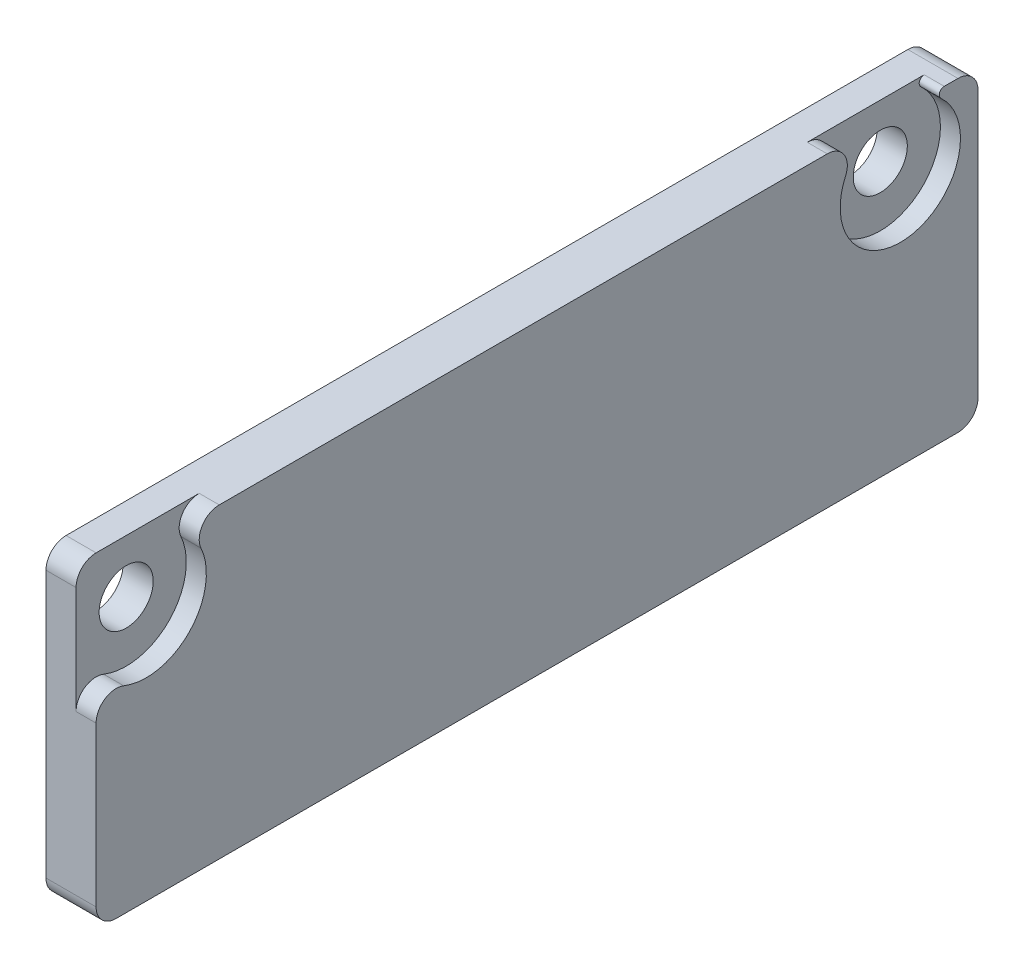
ISO-10303-21;
HEADER;
FILE_DESCRIPTION(('STEP AP214'),'2;1');
FILE_NAME('part.step','',(''),(''),'','','');
FILE_SCHEMA(('AUTOMOTIVE_DESIGN { 1 0 10303 214 1 1 1 1 }'));
ENDSEC;
DATA;
#1=APPLICATION_CONTEXT('core data for automotive mechanical design processes');
#2=APPLICATION_PROTOCOL_DEFINITION('international standard','automotive_design',2000,#1);
#3=PRODUCT_CONTEXT('',#1,'mechanical');
#4=PRODUCT('Part','Part','',(#3));
#5=PRODUCT_RELATED_PRODUCT_CATEGORY('part','',(#4));
#6=PRODUCT_DEFINITION_FORMATION('','',#4);
#7=PRODUCT_DEFINITION_CONTEXT('part definition',#1,'design');
#8=PRODUCT_DEFINITION('design','',#6,#7);
#9=PRODUCT_DEFINITION_SHAPE('','',#8);
#10=(LENGTH_UNIT() NAMED_UNIT(*) SI_UNIT(.MILLI.,.METRE.));
#11=(NAMED_UNIT(*) PLANE_ANGLE_UNIT() SI_UNIT($,.RADIAN.));
#12=(NAMED_UNIT(*) SI_UNIT($,.STERADIAN.) SOLID_ANGLE_UNIT());
#13=UNCERTAINTY_MEASURE_WITH_UNIT(LENGTH_MEASURE(1.E-05),#10,'distance_accuracy_value','');
#14=(GEOMETRIC_REPRESENTATION_CONTEXT(3) GLOBAL_UNCERTAINTY_ASSIGNED_CONTEXT((#13)) GLOBAL_UNIT_ASSIGNED_CONTEXT((#10,
#11,#12)) REPRESENTATION_CONTEXT('',''));
#15=CARTESIAN_POINT('',(0.,0.,0.));
#16=DIRECTION('',(0.,0.,1.));
#17=DIRECTION('',(1.,0.,0.));
#18=AXIS2_PLACEMENT_3D('',#15,#16,#17);
#19=CARTESIAN_POINT('',(2.5,0.,0.));
#20=DIRECTION('',(-1.,0.,0.));
#21=DIRECTION('',(0.,0.,1.));
#22=AXIS2_PLACEMENT_3D('',#19,#20,#21);
#23=PLANE('',#22);
#24=DIRECTION('',(0.,0.,1.));
#25=VECTOR('',#24,1.);
#26=CARTESIAN_POINT('',(2.5,7.65,22.));
#27=LINE('',#26,#25);
#28=CARTESIAN_POINT('',(2.5,7.65,-21.));
#29=VERTEX_POINT('',#28);
#30=CARTESIAN_POINT('',(2.5,7.65,-20.3164607000811));
#31=VERTEX_POINT('',#30);
#32=EDGE_CURVE('E207',#29,#31,#27,.T.);
#33=ORIENTED_EDGE('',*,*,#32,.T.);
#34=CARTESIAN_POINT('',(2.5,7.4,-20.3164607000811));
#35=DIRECTION('',(-1.,0.,0.));
#36=DIRECTION('',(0.,0.,1.));
#37=AXIS2_PLACEMENT_3D('',#34,#35,#36);
#38=CIRCLE('',#37,0.25);
#39=CARTESIAN_POINT('',(2.5,7.21538461538461,-20.1478868000749));
#40=VERTEX_POINT('',#39);
#41=EDGE_CURVE('E61',#31,#40,#38,.F.);
#42=ORIENTED_EDGE('',*,*,#41,.T.);
#43=CARTESIAN_POINT('',(2.5,5.,-18.125));
#44=DIRECTION('',(-1.,0.,0.));
#45=DIRECTION('',(0.,0.,1.));
#46=AXIS2_PLACEMENT_3D('',#43,#44,#45);
#47=CIRCLE('',#46,3.);
#48=CARTESIAN_POINT('',(2.5,6.2375,-15.3921271983497));
#49=VERTEX_POINT('',#48);
#50=EDGE_CURVE('E229',#40,#49,#47,.T.);
#51=ORIENTED_EDGE('',*,*,#50,.T.);
#52=CARTESIAN_POINT('',(2.5,6.65,-14.4811695977996));
#53=DIRECTION('',(-1.,0.,0.));
#54=DIRECTION('',(0.,0.,1.));
#55=AXIS2_PLACEMENT_3D('',#52,#53,#54);
#56=CIRCLE('',#55,1.);
#57=CARTESIAN_POINT('',(2.5,7.65,-14.4811695977996));
#58=VERTEX_POINT('',#57);
#59=EDGE_CURVE('E262',#49,#58,#56,.F.);
#60=ORIENTED_EDGE('',*,*,#59,.T.);
#61=CARTESIAN_POINT('',(2.5,7.65,15.8561695977996));
#62=VERTEX_POINT('',#61);
#63=EDGE_CURVE('E217',#58,#62,#27,.T.);
#64=ORIENTED_EDGE('',*,*,#63,.T.);
#65=CARTESIAN_POINT('',(2.5,6.65,15.8561695977996));
#66=DIRECTION('',(-1.,0.,0.));
#67=DIRECTION('',(0.,0.,1.));
#68=AXIS2_PLACEMENT_3D('',#65,#66,#67);
#69=CIRCLE('',#68,1.);
#70=CARTESIAN_POINT('',(2.5,6.2375,16.7671271983497));
#71=VERTEX_POINT('',#70);
#72=EDGE_CURVE('E258',#62,#71,#69,.F.);
#73=ORIENTED_EDGE('',*,*,#72,.T.);
#74=CARTESIAN_POINT('',(2.5,5.,19.5));
#75=DIRECTION('',(1.,0.,0.));
#76=DIRECTION('',(0.,0.,-1.));
#77=AXIS2_PLACEMENT_3D('',#74,#75,#76);
#78=CIRCLE('',#77,3.);
#79=CARTESIAN_POINT('',(2.5,2.21892556733913,20.625));
#80=VERTEX_POINT('',#79);
#81=EDGE_CURVE('E243',#80,#71,#78,.T.);
#82=ORIENTED_EDGE('',*,*,#81,.F.);
#83=CARTESIAN_POINT('',(2.5,1.29190075645217,21.));
#84=DIRECTION('',(-1.,0.,0.));
#85=DIRECTION('',(0.,0.,1.));
#86=AXIS2_PLACEMENT_3D('',#83,#84,#85);
#87=CIRCLE('',#86,1.);
#88=CARTESIAN_POINT('',(2.5,1.29190075645217,22.));
#89=VERTEX_POINT('',#88);
#90=EDGE_CURVE('E260',#80,#89,#87,.F.);
#91=ORIENTED_EDGE('',*,*,#90,.T.);
#92=DIRECTION('',(0.,-1.,0.));
#93=VECTOR('',#92,1.);
#94=CARTESIAN_POINT('',(2.5,-7.65,22.));
#95=LINE('',#94,#93);
#96=CARTESIAN_POINT('',(2.5,-6.65,22.));
#97=VERTEX_POINT('',#96);
#98=EDGE_CURVE('E216',#89,#97,#95,.T.);
#99=ORIENTED_EDGE('',*,*,#98,.T.);
#100=CARTESIAN_POINT('',(2.5,-6.65,21.));
#101=DIRECTION('',(-1.,0.,0.));
#102=DIRECTION('',(0.,0.,1.));
#103=AXIS2_PLACEMENT_3D('',#100,#101,#102);
#104=CIRCLE('',#103,1.);
#105=CARTESIAN_POINT('',(2.5,-7.65,21.));
#106=VERTEX_POINT('',#105);
#107=EDGE_CURVE('E253',#97,#106,#104,.F.);
#108=ORIENTED_EDGE('',*,*,#107,.T.);
#109=DIRECTION('',(0.,0.,-1.));
#110=VECTOR('',#109,1.);
#111=CARTESIAN_POINT('',(2.5,-7.65,22.));
#112=LINE('',#111,#110);
#113=CARTESIAN_POINT('',(2.5,-7.65,-21.));
#114=VERTEX_POINT('',#113);
#115=EDGE_CURVE('E220',#106,#114,#112,.T.);
#116=ORIENTED_EDGE('',*,*,#115,.T.);
#117=CARTESIAN_POINT('',(2.5,-6.65,-21.));
#118=DIRECTION('',(-1.,0.,0.));
#119=DIRECTION('',(0.,0.,1.));
#120=AXIS2_PLACEMENT_3D('',#117,#118,#119);
#121=CIRCLE('',#120,1.);
#122=CARTESIAN_POINT('',(2.5,-6.65,-22.));
#123=VERTEX_POINT('',#122);
#124=EDGE_CURVE('E255',#114,#123,#121,.F.);
#125=ORIENTED_EDGE('',*,*,#124,.T.);
#126=DIRECTION('',(0.,1.,0.));
#127=VECTOR('',#126,1.);
#128=CARTESIAN_POINT('',(2.5,-7.65,-22.));
#129=LINE('',#128,#127);
#130=CARTESIAN_POINT('',(2.5,6.65,-22.));
#131=VERTEX_POINT('',#130);
#132=EDGE_CURVE('E223',#123,#131,#129,.T.);
#133=ORIENTED_EDGE('',*,*,#132,.T.);
#134=CARTESIAN_POINT('',(2.5,6.65,-21.));
#135=DIRECTION('',(-1.,0.,0.));
#136=DIRECTION('',(0.,0.,1.));
#137=AXIS2_PLACEMENT_3D('',#134,#135,#136);
#138=CIRCLE('',#137,1.);
#139=EDGE_CURVE('E215',#131,#29,#138,.F.);
#140=ORIENTED_EDGE('',*,*,#139,.T.);
#141=EDGE_LOOP('',(#33,#42,#51,#60,#64,#73,#82,#91,#99,#108,#116,#125,#133,#140));
#142=FACE_BOUND('',#141,.T.);
#143=ADVANCED_FACE('F39',(#142),#23,.F.);
#144=CARTESIAN_POINT('',(2.5,-7.65,-22.));
#145=DIRECTION('',(0.,0.,1.));
#146=DIRECTION('',(1.,0.,0.));
#147=AXIS2_PLACEMENT_3D('',#144,#145,#146);
#148=PLANE('',#147);
#149=DIRECTION('',(0.,1.,0.));
#150=VECTOR('',#149,1.);
#151=CARTESIAN_POINT('',(0.,-7.65,-22.));
#152=LINE('',#151,#150);
#153=CARTESIAN_POINT('',(0.,-6.65,-22.));
#154=VERTEX_POINT('',#153);
#155=CARTESIAN_POINT('',(0.,6.65,-22.));
#156=VERTEX_POINT('',#155);
#157=EDGE_CURVE('E230',#154,#156,#152,.T.);
#158=ORIENTED_EDGE('',*,*,#157,.T.);
#159=DIRECTION('',(-1.,0.,0.));
#160=VECTOR('',#159,1.);
#161=CARTESIAN_POINT('',(2.5,6.65,-22.));
#162=LINE('',#161,#160);
#163=EDGE_CURVE('E185',#156,#131,#162,.F.);
#164=ORIENTED_EDGE('',*,*,#163,.T.);
#165=ORIENTED_EDGE('',*,*,#132,.F.);
#166=DIRECTION('',(-1.,0.,0.));
#167=VECTOR('',#166,1.);
#168=CARTESIAN_POINT('',(2.5,-6.65,-22.));
#169=LINE('',#168,#167);
#170=EDGE_CURVE('E181',#123,#154,#169,.T.);
#171=ORIENTED_EDGE('',*,*,#170,.T.);
#172=EDGE_LOOP('',(#158,#164,#165,#171));
#173=FACE_BOUND('',#172,.T.);
#174=ADVANCED_FACE('F284',(#173),#148,.F.);
#175=CARTESIAN_POINT('',(2.5,7.65,22.));
#176=DIRECTION('',(0.,-1.,0.));
#177=DIRECTION('',(0.,0.,-1.));
#178=AXIS2_PLACEMENT_3D('',#175,#176,#177);
#179=PLANE('',#178);
#180=DIRECTION('',(0.,0.,-1.));
#181=VECTOR('',#180,1.);
#182=CARTESIAN_POINT('',(1.5,7.65,22.));
#183=LINE('',#182,#181);
#184=CARTESIAN_POINT('',(1.5,7.65,-14.4811695977996));
#185=VERTEX_POINT('',#184);
#186=CARTESIAN_POINT('',(1.5,7.65,-20.3164607000811));
#187=VERTEX_POINT('',#186);
#188=EDGE_CURVE('E210',#185,#187,#183,.T.);
#189=ORIENTED_EDGE('',*,*,#188,.T.);
#190=DIRECTION('',(1.,0.,0.));
#191=VECTOR('',#190,1.);
#192=CARTESIAN_POINT('',(2.5,7.65,-20.3164607000811));
#193=LINE('',#192,#191);
#194=EDGE_CURVE('E202',#187,#31,#193,.T.);
#195=ORIENTED_EDGE('',*,*,#194,.T.);
#196=ORIENTED_EDGE('',*,*,#32,.F.);
#197=DIRECTION('',(-1.,0.,0.));
#198=VECTOR('',#197,1.);
#199=CARTESIAN_POINT('',(2.5,7.65,-21.));
#200=LINE('',#199,#198);
#201=CARTESIAN_POINT('',(0.,7.65,-21.));
#202=VERTEX_POINT('',#201);
#203=EDGE_CURVE('E164',#29,#202,#200,.T.);
#204=ORIENTED_EDGE('',*,*,#203,.T.);
#205=DIRECTION('',(0.,0.,1.));
#206=VECTOR('',#205,1.);
#207=CARTESIAN_POINT('',(0.,7.65,22.));
#208=LINE('',#207,#206);
#209=CARTESIAN_POINT('',(0.,7.65,21.));
#210=VERTEX_POINT('',#209);
#211=EDGE_CURVE('E160',#202,#210,#208,.T.);
#212=ORIENTED_EDGE('',*,*,#211,.T.);
#213=DIRECTION('',(-1.,0.,0.));
#214=VECTOR('',#213,1.);
#215=CARTESIAN_POINT('',(2.5,7.65,21.));
#216=LINE('',#215,#214);
#217=CARTESIAN_POINT('',(1.5,7.65,21.));
#218=VERTEX_POINT('',#217);
#219=EDGE_CURVE('E152',#210,#218,#216,.F.);
#220=ORIENTED_EDGE('',*,*,#219,.T.);
#221=DIRECTION('',(0.,0.,-1.));
#222=VECTOR('',#221,1.);
#223=CARTESIAN_POINT('',(1.5,7.65,22.));
#224=LINE('',#223,#222);
#225=CARTESIAN_POINT('',(1.5,7.65,15.8561695977996));
#226=VERTEX_POINT('',#225);
#227=EDGE_CURVE('E156',#218,#226,#224,.T.);
#228=ORIENTED_EDGE('',*,*,#227,.T.);
#229=DIRECTION('',(1.,0.,0.));
#230=VECTOR('',#229,1.);
#231=CARTESIAN_POINT('',(2.5,7.65,15.8561695977996));
#232=LINE('',#231,#230);
#233=EDGE_CURVE('E163',#226,#62,#232,.T.);
#234=ORIENTED_EDGE('',*,*,#233,.T.);
#235=ORIENTED_EDGE('',*,*,#63,.F.);
#236=DIRECTION('',(1.,0.,0.));
#237=VECTOR('',#236,1.);
#238=CARTESIAN_POINT('',(2.5,7.65,-14.4811695977996));
#239=LINE('',#238,#237);
#240=EDGE_CURVE('E248',#58,#185,#239,.F.);
#241=ORIENTED_EDGE('',*,*,#240,.T.);
#242=EDGE_LOOP('',(#189,#195,#196,#204,#212,#220,#228,#234,#235,#241));
#243=FACE_BOUND('',#242,.T.);
#244=ADVANCED_FACE('F154',(#243),#179,.F.);
#245=CARTESIAN_POINT('',(2.5,-7.65,22.));
#246=DIRECTION('',(0.,0.,-1.));
#247=DIRECTION('',(-1.,0.,0.));
#248=AXIS2_PLACEMENT_3D('',#245,#246,#247);
#249=PLANE('',#248);
#250=ORIENTED_EDGE('',*,*,#98,.F.);
#251=DIRECTION('',(1.,0.,0.));
#252=VECTOR('',#251,1.);
#253=CARTESIAN_POINT('',(2.5,1.29190075645217,22.));
#254=LINE('',#253,#252);
#255=CARTESIAN_POINT('',(1.5,1.29190075645217,22.));
#256=VERTEX_POINT('',#255);
#257=EDGE_CURVE('E267',#89,#256,#254,.F.);
#258=ORIENTED_EDGE('',*,*,#257,.T.);
#259=DIRECTION('',(0.,1.,0.));
#260=VECTOR('',#259,1.);
#261=CARTESIAN_POINT('',(1.5,-7.65,22.));
#262=LINE('',#261,#260);
#263=CARTESIAN_POINT('',(1.5,6.65,22.));
#264=VERTEX_POINT('',#263);
#265=EDGE_CURVE('E244',#256,#264,#262,.T.);
#266=ORIENTED_EDGE('',*,*,#265,.T.);
#267=DIRECTION('',(-1.,0.,0.));
#268=VECTOR('',#267,1.);
#269=CARTESIAN_POINT('',(2.5,6.65,22.));
#270=LINE('',#269,#268);
#271=CARTESIAN_POINT('',(0.,6.65,22.));
#272=VERTEX_POINT('',#271);
#273=EDGE_CURVE('E180',#264,#272,#270,.T.);
#274=ORIENTED_EDGE('',*,*,#273,.T.);
#275=DIRECTION('',(0.,-1.,0.));
#276=VECTOR('',#275,1.);
#277=CARTESIAN_POINT('',(0.,-7.65,22.));
#278=LINE('',#277,#276);
#279=CARTESIAN_POINT('',(0.,-6.65,22.));
#280=VERTEX_POINT('',#279);
#281=EDGE_CURVE('E235',#272,#280,#278,.T.);
#282=ORIENTED_EDGE('',*,*,#281,.T.);
#283=DIRECTION('',(-1.,0.,0.));
#284=VECTOR('',#283,1.);
#285=CARTESIAN_POINT('',(2.5,-6.65,22.));
#286=LINE('',#285,#284);
#287=EDGE_CURVE('E264',#280,#97,#286,.F.);
#288=ORIENTED_EDGE('',*,*,#287,.T.);
#289=EDGE_LOOP('',(#250,#258,#266,#274,#282,#288));
#290=FACE_BOUND('',#289,.T.);
#291=ADVANCED_FACE('F319',(#290),#249,.F.);
#292=CARTESIAN_POINT('',(2.5,-7.65,22.));
#293=DIRECTION('',(0.,1.,0.));
#294=DIRECTION('',(0.,0.,1.));
#295=AXIS2_PLACEMENT_3D('',#292,#293,#294);
#296=PLANE('',#295);
#297=DIRECTION('',(0.,0.,-1.));
#298=VECTOR('',#297,1.);
#299=CARTESIAN_POINT('',(0.,-7.65,22.));
#300=LINE('',#299,#298);
#301=CARTESIAN_POINT('',(0.,-7.65,21.));
#302=VERTEX_POINT('',#301);
#303=CARTESIAN_POINT('',(0.,-7.65,-21.));
#304=VERTEX_POINT('',#303);
#305=EDGE_CURVE('E238',#302,#304,#300,.T.);
#306=ORIENTED_EDGE('',*,*,#305,.T.);
#307=DIRECTION('',(-1.,0.,0.));
#308=VECTOR('',#307,1.);
#309=CARTESIAN_POINT('',(2.5,-7.65,-21.));
#310=LINE('',#309,#308);
#311=EDGE_CURVE('E195',#304,#114,#310,.F.);
#312=ORIENTED_EDGE('',*,*,#311,.T.);
#313=ORIENTED_EDGE('',*,*,#115,.F.);
#314=DIRECTION('',(-1.,0.,0.));
#315=VECTOR('',#314,1.);
#316=CARTESIAN_POINT('',(2.5,-7.65,21.));
#317=LINE('',#316,#315);
#318=EDGE_CURVE('E192',#106,#302,#317,.T.);
#319=ORIENTED_EDGE('',*,*,#318,.T.);
#320=EDGE_LOOP('',(#306,#312,#313,#319));
#321=FACE_BOUND('',#320,.T.);
#322=ADVANCED_FACE('F315',(#321),#296,.F.);
#323=CARTESIAN_POINT('',(0.,0.,0.));
#324=DIRECTION('',(-1.,0.,0.));
#325=DIRECTION('',(0.,0.,1.));
#326=AXIS2_PLACEMENT_3D('',#323,#324,#325);
#327=PLANE('',#326);
#328=CARTESIAN_POINT('',(0.,5.,19.5));
#329=DIRECTION('',(1.,0.,0.));
#330=DIRECTION('',(0.,0.,-1.));
#331=AXIS2_PLACEMENT_3D('',#328,#329,#330);
#332=CIRCLE('',#331,1.35);
#333=CARTESIAN_POINT('',(0.,5.,18.15));
#334=VERTEX_POINT('',#333);
#335=EDGE_CURVE('E175',#334,#334,#332,.T.);
#336=ORIENTED_EDGE('',*,*,#335,.T.);
#337=EDGE_LOOP('',(#336));
#338=FACE_BOUND('',#337,.T.);
#339=CARTESIAN_POINT('',(0.,5.,-18.125));
#340=DIRECTION('',(1.,0.,0.));
#341=DIRECTION('',(0.,0.,-1.));
#342=AXIS2_PLACEMENT_3D('',#339,#340,#341);
#343=CIRCLE('',#342,1.35);
#344=CARTESIAN_POINT('',(0.,5.,-19.475));
#345=VERTEX_POINT('',#344);
#346=EDGE_CURVE('E233',#345,#345,#343,.T.);
#347=ORIENTED_EDGE('',*,*,#346,.T.);
#348=EDGE_LOOP('',(#347));
#349=FACE_BOUND('',#348,.T.);
#350=ORIENTED_EDGE('',*,*,#281,.F.);
#351=CARTESIAN_POINT('',(0.,6.65,21.));
#352=DIRECTION('',(-1.,0.,0.));
#353=DIRECTION('',(0.,0.,1.));
#354=AXIS2_PLACEMENT_3D('',#351,#352,#353);
#355=CIRCLE('',#354,1.);
#356=EDGE_CURVE('E182',#272,#210,#355,.T.);
#357=ORIENTED_EDGE('',*,*,#356,.T.);
#358=ORIENTED_EDGE('',*,*,#211,.F.);
#359=CARTESIAN_POINT('',(0.,6.65,-21.));
#360=DIRECTION('',(-1.,0.,0.));
#361=DIRECTION('',(0.,0.,1.));
#362=AXIS2_PLACEMENT_3D('',#359,#360,#361);
#363=CIRCLE('',#362,1.);
#364=EDGE_CURVE('E187',#202,#156,#363,.T.);
#365=ORIENTED_EDGE('',*,*,#364,.T.);
#366=ORIENTED_EDGE('',*,*,#157,.F.);
#367=CARTESIAN_POINT('',(0.,-6.65,-21.));
#368=DIRECTION('',(-1.,0.,0.));
#369=DIRECTION('',(0.,0.,1.));
#370=AXIS2_PLACEMENT_3D('',#367,#368,#369);
#371=CIRCLE('',#370,1.);
#372=EDGE_CURVE('E276',#154,#304,#371,.T.);
#373=ORIENTED_EDGE('',*,*,#372,.T.);
#374=ORIENTED_EDGE('',*,*,#305,.F.);
#375=CARTESIAN_POINT('',(0.,-6.65,21.));
#376=DIRECTION('',(-1.,0.,0.));
#377=DIRECTION('',(0.,0.,1.));
#378=AXIS2_PLACEMENT_3D('',#375,#376,#377);
#379=CIRCLE('',#378,1.);
#380=EDGE_CURVE('E274',#302,#280,#379,.T.);
#381=ORIENTED_EDGE('',*,*,#380,.T.);
#382=EDGE_LOOP('',(#350,#357,#358,#365,#366,#373,#374,#381));
#383=FACE_BOUND('',#382,.T.);
#384=ADVANCED_FACE('F280',(#338,#349,#383),#327,.T.);
#385=CARTESIAN_POINT('',(1.5,6.35,-18.125));
#386=DIRECTION('',(-1.,0.,0.));
#387=DIRECTION('',(0.,0.,1.));
#388=AXIS2_PLACEMENT_3D('',#385,#386,#387);
#389=PLANE('',#388);
#390=CARTESIAN_POINT('',(1.5,5.,-18.125));
#391=DIRECTION('',(1.,0.,0.));
#392=DIRECTION('',(0.,0.,-1.));
#393=AXIS2_PLACEMENT_3D('',#390,#391,#392);
#394=CIRCLE('',#393,1.35);
#395=CARTESIAN_POINT('',(1.5,5.,-19.475));
#396=VERTEX_POINT('',#395);
#397=EDGE_CURVE('E348',#396,#396,#394,.T.);
#398=ORIENTED_EDGE('',*,*,#397,.F.);
#399=EDGE_LOOP('',(#398));
#400=FACE_BOUND('',#399,.T.);
#401=ORIENTED_EDGE('',*,*,#188,.F.);
#402=CARTESIAN_POINT('',(1.5,6.65,-14.4811695977996));
#403=DIRECTION('',(-1.,0.,0.));
#404=DIRECTION('',(0.,0.,1.));
#405=AXIS2_PLACEMENT_3D('',#402,#403,#404);
#406=CIRCLE('',#405,1.);
#407=CARTESIAN_POINT('',(1.5,6.2375,-15.3921271983497));
#408=VERTEX_POINT('',#407);
#409=EDGE_CURVE('E197',#185,#408,#406,.T.);
#410=ORIENTED_EDGE('',*,*,#409,.T.);
#411=CARTESIAN_POINT('',(1.5,5.,-18.125));
#412=DIRECTION('',(1.,0.,0.));
#413=DIRECTION('',(0.,0.,-1.));
#414=AXIS2_PLACEMENT_3D('',#411,#412,#413);
#415=CIRCLE('',#414,3.);
#416=CARTESIAN_POINT('',(1.5,7.21538461538461,-20.1478868000749));
#417=VERTEX_POINT('',#416);
#418=EDGE_CURVE('E174',#408,#417,#415,.T.);
#419=ORIENTED_EDGE('',*,*,#418,.T.);
#420=CARTESIAN_POINT('',(1.5,7.4,-20.3164607000811));
#421=DIRECTION('',(-1.,0.,0.));
#422=DIRECTION('',(0.,0.,1.));
#423=AXIS2_PLACEMENT_3D('',#420,#421,#422);
#424=CIRCLE('',#423,0.25);
#425=EDGE_CURVE('E11',#417,#187,#424,.T.);
#426=ORIENTED_EDGE('',*,*,#425,.T.);
#427=EDGE_LOOP('',(#401,#410,#419,#426));
#428=FACE_BOUND('',#427,.T.);
#429=ADVANCED_FACE('F314',(#400,#428),#389,.F.);
#430=CARTESIAN_POINT('',(2.5,5.,-18.125));
#431=DIRECTION('',(1.,0.,0.));
#432=DIRECTION('',(0.,0.,-1.));
#433=AXIS2_PLACEMENT_3D('',#430,#431,#432);
#434=CYLINDRICAL_SURFACE('',#433,3.);
#435=ORIENTED_EDGE('',*,*,#50,.F.);
#436=DIRECTION('',(1.,0.,0.));
#437=VECTOR('',#436,1.);
#438=CARTESIAN_POINT('',(2.5,7.21538461538461,-20.1478868000749));
#439=LINE('',#438,#437);
#440=EDGE_CURVE('E47',#40,#417,#439,.F.);
#441=ORIENTED_EDGE('',*,*,#440,.T.);
#442=ORIENTED_EDGE('',*,*,#418,.F.);
#443=DIRECTION('',(1.,0.,0.));
#444=VECTOR('',#443,1.);
#445=CARTESIAN_POINT('',(2.5,6.2375,-15.3921271983497));
#446=LINE('',#445,#444);
#447=EDGE_CURVE('E250',#408,#49,#446,.T.);
#448=ORIENTED_EDGE('',*,*,#447,.T.);
#449=EDGE_LOOP('',(#435,#441,#442,#448));
#450=FACE_BOUND('',#449,.T.);
#451=ADVANCED_FACE('F347',(#450),#434,.F.);
#452=CARTESIAN_POINT('',(2.5,5.,-18.125));
#453=DIRECTION('',(1.,0.,0.));
#454=DIRECTION('',(0.,0.,-1.));
#455=AXIS2_PLACEMENT_3D('',#452,#453,#454);
#456=CYLINDRICAL_SURFACE('',#455,1.35);
#457=ORIENTED_EDGE('',*,*,#346,.F.);
#458=EDGE_LOOP('',(#457));
#459=FACE_BOUND('',#458,.T.);
#460=ORIENTED_EDGE('',*,*,#397,.T.);
#461=EDGE_LOOP('',(#460));
#462=FACE_BOUND('',#461,.T.);
#463=ADVANCED_FACE('F310',(#459,#462),#456,.F.);
#464=CARTESIAN_POINT('',(1.5,6.35,19.5));
#465=DIRECTION('',(-1.,0.,0.));
#466=DIRECTION('',(0.,0.,1.));
#467=AXIS2_PLACEMENT_3D('',#464,#465,#466);
#468=PLANE('',#467);
#469=CARTESIAN_POINT('',(1.5,5.,19.5));
#470=DIRECTION('',(1.,0.,0.));
#471=DIRECTION('',(0.,0.,-1.));
#472=AXIS2_PLACEMENT_3D('',#469,#470,#471);
#473=CIRCLE('',#472,1.35);
#474=CARTESIAN_POINT('',(1.5,5.,18.15));
#475=VERTEX_POINT('',#474);
#476=EDGE_CURVE('E381',#475,#475,#473,.T.);
#477=ORIENTED_EDGE('',*,*,#476,.F.);
#478=EDGE_LOOP('',(#477));
#479=FACE_BOUND('',#478,.T.);
#480=ORIENTED_EDGE('',*,*,#227,.F.);
#481=CARTESIAN_POINT('',(1.5,6.65,21.));
#482=DIRECTION('',(-1.,0.,0.));
#483=DIRECTION('',(0.,0.,1.));
#484=AXIS2_PLACEMENT_3D('',#481,#482,#483);
#485=CIRCLE('',#484,1.);
#486=EDGE_CURVE('E168',#218,#264,#485,.F.);
#487=ORIENTED_EDGE('',*,*,#486,.T.);
#488=ORIENTED_EDGE('',*,*,#265,.F.);
#489=CARTESIAN_POINT('',(1.5,1.29190075645217,21.));
#490=DIRECTION('',(-1.,0.,0.));
#491=DIRECTION('',(0.,0.,1.));
#492=AXIS2_PLACEMENT_3D('',#489,#490,#491);
#493=CIRCLE('',#492,1.);
#494=CARTESIAN_POINT('',(1.5,2.21892556733913,20.625));
#495=VERTEX_POINT('',#494);
#496=EDGE_CURVE('E199',#256,#495,#493,.T.);
#497=ORIENTED_EDGE('',*,*,#496,.T.);
#498=CARTESIAN_POINT('',(1.5,5.,19.5));
#499=DIRECTION('',(1.,0.,0.));
#500=DIRECTION('',(0.,0.,-1.));
#501=AXIS2_PLACEMENT_3D('',#498,#499,#500);
#502=CIRCLE('',#501,3.);
#503=CARTESIAN_POINT('',(1.5,6.2375,16.7671271983497));
#504=VERTEX_POINT('',#503);
#505=EDGE_CURVE('E379',#495,#504,#502,.T.);
#506=ORIENTED_EDGE('',*,*,#505,.T.);
#507=CARTESIAN_POINT('',(1.5,6.65,15.8561695977996));
#508=DIRECTION('',(-1.,0.,0.));
#509=DIRECTION('',(0.,0.,1.));
#510=AXIS2_PLACEMENT_3D('',#507,#508,#509);
#511=CIRCLE('',#510,1.);
#512=EDGE_CURVE('E172',#504,#226,#511,.T.);
#513=ORIENTED_EDGE('',*,*,#512,.T.);
#514=EDGE_LOOP('',(#480,#487,#488,#497,#506,#513));
#515=FACE_BOUND('',#514,.T.);
#516=ADVANCED_FACE('F167',(#479,#515),#468,.F.);
#517=CARTESIAN_POINT('',(2.5,5.,19.5));
#518=DIRECTION('',(1.,0.,0.));
#519=DIRECTION('',(0.,0.,-1.));
#520=AXIS2_PLACEMENT_3D('',#517,#518,#519);
#521=CYLINDRICAL_SURFACE('',#520,3.);
#522=ORIENTED_EDGE('',*,*,#505,.F.);
#523=DIRECTION('',(1.,0.,0.));
#524=VECTOR('',#523,1.);
#525=CARTESIAN_POINT('',(2.5,2.21892556733913,20.625));
#526=LINE('',#525,#524);
#527=EDGE_CURVE('E272',#495,#80,#526,.T.);
#528=ORIENTED_EDGE('',*,*,#527,.T.);
#529=ORIENTED_EDGE('',*,*,#81,.T.);
#530=DIRECTION('',(1.,0.,0.));
#531=VECTOR('',#530,1.);
#532=CARTESIAN_POINT('',(2.5,6.2375,16.7671271983497));
#533=LINE('',#532,#531);
#534=EDGE_CURVE('E270',#71,#504,#533,.F.);
#535=ORIENTED_EDGE('',*,*,#534,.T.);
#536=EDGE_LOOP('',(#522,#528,#529,#535));
#537=FACE_BOUND('',#536,.T.);
#538=ADVANCED_FACE('F369',(#537),#521,.F.);
#539=CARTESIAN_POINT('',(2.5,5.,19.5));
#540=DIRECTION('',(1.,0.,0.));
#541=DIRECTION('',(0.,0.,-1.));
#542=AXIS2_PLACEMENT_3D('',#539,#540,#541);
#543=CYLINDRICAL_SURFACE('',#542,1.35);
#544=ORIENTED_EDGE('',*,*,#335,.F.);
#545=EDGE_LOOP('',(#544));
#546=FACE_BOUND('',#545,.T.);
#547=ORIENTED_EDGE('',*,*,#476,.T.);
#548=EDGE_LOOP('',(#547));
#549=FACE_BOUND('',#548,.T.);
#550=ADVANCED_FACE('F329',(#546,#549),#543,.F.);
#551=CARTESIAN_POINT('',(2.5,6.65,-14.4811695977996));
#552=DIRECTION('',(1.,0.,0.));
#553=DIRECTION('',(0.,0.,-1.));
#554=AXIS2_PLACEMENT_3D('',#551,#552,#553);
#555=CYLINDRICAL_SURFACE('',#554,1.);
#556=ORIENTED_EDGE('',*,*,#59,.F.);
#557=ORIENTED_EDGE('',*,*,#447,.F.);
#558=ORIENTED_EDGE('',*,*,#409,.F.);
#559=ORIENTED_EDGE('',*,*,#240,.F.);
#560=EDGE_LOOP('',(#556,#557,#558,#559));
#561=FACE_BOUND('',#560,.T.);
#562=ADVANCED_FACE('F325',(#561),#555,.T.);
#563=CARTESIAN_POINT('',(2.5,1.29190075645217,21.));
#564=DIRECTION('',(1.,0.,0.));
#565=DIRECTION('',(0.,0.,-1.));
#566=AXIS2_PLACEMENT_3D('',#563,#564,#565);
#567=CYLINDRICAL_SURFACE('',#566,1.);
#568=ORIENTED_EDGE('',*,*,#90,.F.);
#569=ORIENTED_EDGE('',*,*,#527,.F.);
#570=ORIENTED_EDGE('',*,*,#496,.F.);
#571=ORIENTED_EDGE('',*,*,#257,.F.);
#572=EDGE_LOOP('',(#568,#569,#570,#571));
#573=FACE_BOUND('',#572,.T.);
#574=ADVANCED_FACE('F328',(#573),#567,.T.);
#575=CARTESIAN_POINT('',(2.5,6.65,15.8561695977996));
#576=DIRECTION('',(1.,0.,0.));
#577=DIRECTION('',(0.,0.,-1.));
#578=AXIS2_PLACEMENT_3D('',#575,#576,#577);
#579=CYLINDRICAL_SURFACE('',#578,1.);
#580=ORIENTED_EDGE('',*,*,#512,.F.);
#581=ORIENTED_EDGE('',*,*,#534,.F.);
#582=ORIENTED_EDGE('',*,*,#72,.F.);
#583=ORIENTED_EDGE('',*,*,#233,.F.);
#584=EDGE_LOOP('',(#580,#581,#582,#583));
#585=FACE_BOUND('',#584,.T.);
#586=ADVANCED_FACE('F298',(#585),#579,.T.);
#587=CARTESIAN_POINT('',(2.5,6.65,21.));
#588=DIRECTION('',(-1.,0.,0.));
#589=DIRECTION('',(0.,0.,1.));
#590=AXIS2_PLACEMENT_3D('',#587,#588,#589);
#591=CYLINDRICAL_SURFACE('',#590,1.);
#592=ORIENTED_EDGE('',*,*,#486,.F.);
#593=ORIENTED_EDGE('',*,*,#219,.F.);
#594=ORIENTED_EDGE('',*,*,#356,.F.);
#595=ORIENTED_EDGE('',*,*,#273,.F.);
#596=EDGE_LOOP('',(#592,#593,#594,#595));
#597=FACE_BOUND('',#596,.T.);
#598=ADVANCED_FACE('F178',(#597),#591,.T.);
#599=CARTESIAN_POINT('',(2.5,6.65,-21.));
#600=DIRECTION('',(-1.,0.,0.));
#601=DIRECTION('',(0.,0.,1.));
#602=AXIS2_PLACEMENT_3D('',#599,#600,#601);
#603=CYLINDRICAL_SURFACE('',#602,1.);
#604=ORIENTED_EDGE('',*,*,#139,.F.);
#605=ORIENTED_EDGE('',*,*,#163,.F.);
#606=ORIENTED_EDGE('',*,*,#364,.F.);
#607=ORIENTED_EDGE('',*,*,#203,.F.);
#608=EDGE_LOOP('',(#604,#605,#606,#607));
#609=FACE_BOUND('',#608,.T.);
#610=ADVANCED_FACE('F287',(#609),#603,.T.);
#611=CARTESIAN_POINT('',(2.5,-6.65,-21.));
#612=DIRECTION('',(-1.,0.,0.));
#613=DIRECTION('',(0.,0.,1.));
#614=AXIS2_PLACEMENT_3D('',#611,#612,#613);
#615=CYLINDRICAL_SURFACE('',#614,1.);
#616=ORIENTED_EDGE('',*,*,#124,.F.);
#617=ORIENTED_EDGE('',*,*,#311,.F.);
#618=ORIENTED_EDGE('',*,*,#372,.F.);
#619=ORIENTED_EDGE('',*,*,#170,.F.);
#620=EDGE_LOOP('',(#616,#617,#618,#619));
#621=FACE_BOUND('',#620,.T.);
#622=ADVANCED_FACE('F289',(#621),#615,.T.);
#623=CARTESIAN_POINT('',(2.5,-6.65,21.));
#624=DIRECTION('',(-1.,0.,0.));
#625=DIRECTION('',(0.,0.,1.));
#626=AXIS2_PLACEMENT_3D('',#623,#624,#625);
#627=CYLINDRICAL_SURFACE('',#626,1.);
#628=ORIENTED_EDGE('',*,*,#107,.F.);
#629=ORIENTED_EDGE('',*,*,#287,.F.);
#630=ORIENTED_EDGE('',*,*,#380,.F.);
#631=ORIENTED_EDGE('',*,*,#318,.F.);
#632=EDGE_LOOP('',(#628,#629,#630,#631));
#633=FACE_BOUND('',#632,.T.);
#634=ADVANCED_FACE('F295',(#633),#627,.T.);
#635=CARTESIAN_POINT('',(2.5,7.4,-20.3164607000811));
#636=DIRECTION('',(1.,0.,0.));
#637=DIRECTION('',(0.,0.,-1.));
#638=AXIS2_PLACEMENT_3D('',#635,#636,#637);
#639=CYLINDRICAL_SURFACE('',#638,0.25);
#640=ORIENTED_EDGE('',*,*,#425,.F.);
#641=ORIENTED_EDGE('',*,*,#440,.F.);
#642=ORIENTED_EDGE('',*,*,#41,.F.);
#643=ORIENTED_EDGE('',*,*,#194,.F.);
#644=EDGE_LOOP('',(#640,#641,#642,#643));
#645=FACE_BOUND('',#644,.T.);
#646=ADVANCED_FACE('F41',(#645),#639,.T.);
#647=CLOSED_SHELL('',(#143,#174,#244,#291,#322,#384,#429,#451,#463,#516,#538,#550,#562,#574,
#586,#598,#610,#622,#634,#646));
#648=MANIFOLD_SOLID_BREP('B2',#647);
#649=ADVANCED_BREP_SHAPE_REPRESENTATION('',(#18,#648),#14);
#650=SHAPE_DEFINITION_REPRESENTATION(#9,#649);
ENDSEC;
END-ISO-10303-21;
